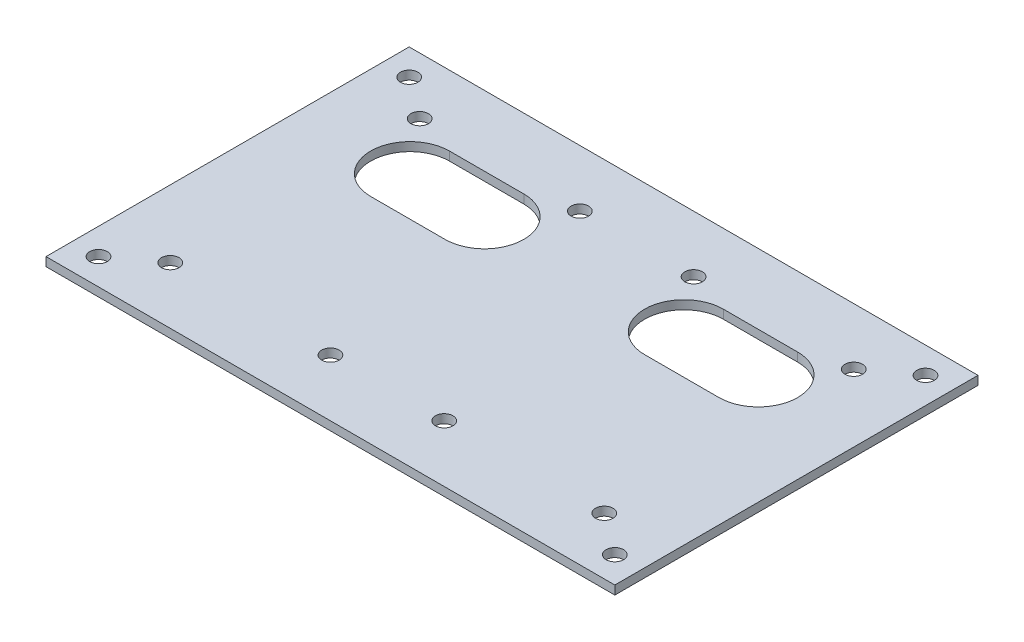
ISO-10303-21;
HEADER;
FILE_DESCRIPTION(('STEP AP214'),'2;1');
FILE_NAME('part.step','',(''),(''),'','','');
FILE_SCHEMA(('AUTOMOTIVE_DESIGN { 1 0 10303 214 1 1 1 1 }'));
ENDSEC;
DATA;
#1=APPLICATION_CONTEXT('core data for automotive mechanical design processes');
#2=APPLICATION_PROTOCOL_DEFINITION('international standard','automotive_design',2000,#1);
#3=PRODUCT_CONTEXT('',#1,'mechanical');
#4=PRODUCT('Part','Part','',(#3));
#5=PRODUCT_RELATED_PRODUCT_CATEGORY('part','',(#4));
#6=PRODUCT_DEFINITION_FORMATION('','',#4);
#7=PRODUCT_DEFINITION_CONTEXT('part definition',#1,'design');
#8=PRODUCT_DEFINITION('design','',#6,#7);
#9=PRODUCT_DEFINITION_SHAPE('','',#8);
#10=(LENGTH_UNIT() NAMED_UNIT(*) SI_UNIT(.MILLI.,.METRE.));
#11=(NAMED_UNIT(*) PLANE_ANGLE_UNIT() SI_UNIT($,.RADIAN.));
#12=(NAMED_UNIT(*) SI_UNIT($,.STERADIAN.) SOLID_ANGLE_UNIT());
#13=UNCERTAINTY_MEASURE_WITH_UNIT(LENGTH_MEASURE(1.E-05),#10,'distance_accuracy_value','');
#14=(GEOMETRIC_REPRESENTATION_CONTEXT(3) GLOBAL_UNCERTAINTY_ASSIGNED_CONTEXT((#13)) GLOBAL_UNIT_ASSIGNED_CONTEXT((#10,
#11,#12)) REPRESENTATION_CONTEXT('',''));
#15=CARTESIAN_POINT('',(0.,0.,0.));
#16=DIRECTION('',(0.,0.,1.));
#17=DIRECTION('',(1.,0.,0.));
#18=AXIS2_PLACEMENT_3D('',#15,#16,#17);
#19=CARTESIAN_POINT('',(0.,2.,0.));
#20=DIRECTION('',(0.,1.,0.));
#21=DIRECTION('',(0.,0.,1.));
#22=AXIS2_PLACEMENT_3D('',#19,#20,#21);
#23=PLANE('',#22);
#24=CARTESIAN_POINT('',(59.,2.,35.5));
#25=DIRECTION('',(0.,1.,0.));
#26=DIRECTION('',(0.,0.,1.));
#27=AXIS2_PLACEMENT_3D('',#24,#25,#26);
#28=CIRCLE('',#27,2.);
#29=CARTESIAN_POINT('',(59.,2.,37.5));
#30=VERTEX_POINT('',#29);
#31=EDGE_CURVE('E197',#30,#30,#28,.T.);
#32=ORIENTED_EDGE('',*,*,#31,.F.);
#33=EDGE_LOOP('',(#32));
#34=FACE_BOUND('',#33,.T.);
#35=CARTESIAN_POINT('',(-59.,2.,-35.5));
#36=DIRECTION('',(0.,1.,0.));
#37=DIRECTION('',(0.,0.,1.));
#38=AXIS2_PLACEMENT_3D('',#35,#36,#37);
#39=CIRCLE('',#38,2.);
#40=CARTESIAN_POINT('',(-59.,2.,-33.5));
#41=VERTEX_POINT('',#40);
#42=EDGE_CURVE('E209',#41,#41,#39,.T.);
#43=ORIENTED_EDGE('',*,*,#42,.F.);
#44=EDGE_LOOP('',(#43));
#45=FACE_BOUND('',#44,.T.);
#46=CARTESIAN_POINT('',(-49.6,2.,-28.5));
#47=DIRECTION('',(0.,1.,0.));
#48=DIRECTION('',(0.,0.,-1.));
#49=AXIS2_PLACEMENT_3D('',#46,#47,#48);
#50=CIRCLE('',#49,2.);
#51=CARTESIAN_POINT('',(-49.6,2.,-30.5));
#52=VERTEX_POINT('',#51);
#53=EDGE_CURVE('E221',#52,#52,#50,.T.);
#54=ORIENTED_EDGE('',*,*,#53,.F.);
#55=EDGE_LOOP('',(#54));
#56=FACE_BOUND('',#55,.T.);
#57=CARTESIAN_POINT('',(-13.,2.,28.4999999999999));
#58=DIRECTION('',(0.,1.,0.));
#59=DIRECTION('',(0.,0.,-1.));
#60=AXIS2_PLACEMENT_3D('',#57,#58,#59);
#61=CIRCLE('',#60,2.);
#62=CARTESIAN_POINT('',(-13.,2.,26.4999999999999));
#63=VERTEX_POINT('',#62);
#64=EDGE_CURVE('E233',#63,#63,#61,.T.);
#65=ORIENTED_EDGE('',*,*,#64,.F.);
#66=EDGE_LOOP('',(#65));
#67=FACE_BOUND('',#66,.T.);
#68=CARTESIAN_POINT('',(49.6,2.,28.5));
#69=DIRECTION('',(0.,1.,0.));
#70=DIRECTION('',(0.,0.,1.));
#71=AXIS2_PLACEMENT_3D('',#68,#69,#70);
#72=CIRCLE('',#71,2.);
#73=CARTESIAN_POINT('',(49.6,2.,30.5));
#74=VERTEX_POINT('',#73);
#75=EDGE_CURVE('E245',#74,#74,#72,.T.);
#76=ORIENTED_EDGE('',*,*,#75,.F.);
#77=EDGE_LOOP('',(#76));
#78=FACE_BOUND('',#77,.T.);
#79=CARTESIAN_POINT('',(13.,2.,-28.5));
#80=DIRECTION('',(0.,1.,0.));
#81=DIRECTION('',(0.,0.,1.));
#82=AXIS2_PLACEMENT_3D('',#79,#80,#81);
#83=CIRCLE('',#82,2.);
#84=CARTESIAN_POINT('',(13.,2.,-26.5));
#85=VERTEX_POINT('',#84);
#86=EDGE_CURVE('E257',#85,#85,#83,.T.);
#87=ORIENTED_EDGE('',*,*,#86,.F.);
#88=EDGE_LOOP('',(#87));
#89=FACE_BOUND('',#88,.T.);
#90=DIRECTION('',(0.,0.,-1.));
#91=VECTOR('',#90,1.);
#92=CARTESIAN_POINT('',(65.,2.,-41.5));
#93=LINE('',#92,#91);
#94=CARTESIAN_POINT('',(65.,2.,41.5));
#95=VERTEX_POINT('',#94);
#96=CARTESIAN_POINT('',(65.,2.,-41.5));
#97=VERTEX_POINT('',#96);
#98=EDGE_CURVE('E263',#95,#97,#93,.T.);
#99=ORIENTED_EDGE('',*,*,#98,.T.);
#100=DIRECTION('',(-1.,0.,0.));
#101=VECTOR('',#100,1.);
#102=CARTESIAN_POINT('',(-65.,2.,-41.5));
#103=LINE('',#102,#101);
#104=CARTESIAN_POINT('',(-65.,2.,-41.5));
#105=VERTEX_POINT('',#104);
#106=EDGE_CURVE('E266',#97,#105,#103,.T.);
#107=ORIENTED_EDGE('',*,*,#106,.T.);
#108=DIRECTION('',(0.,0.,1.));
#109=VECTOR('',#108,1.);
#110=CARTESIAN_POINT('',(-65.,2.,-41.5));
#111=LINE('',#110,#109);
#112=CARTESIAN_POINT('',(-65.,2.,41.5));
#113=VERTEX_POINT('',#112);
#114=EDGE_CURVE('E269',#105,#113,#111,.T.);
#115=ORIENTED_EDGE('',*,*,#114,.T.);
#116=DIRECTION('',(1.,0.,0.));
#117=VECTOR('',#116,1.);
#118=CARTESIAN_POINT('',(-65.,2.,41.5));
#119=LINE('',#118,#117);
#120=EDGE_CURVE('E271',#113,#95,#119,.T.);
#121=ORIENTED_EDGE('',*,*,#120,.T.);
#122=EDGE_LOOP('',(#99,#107,#115,#121));
#123=FACE_BOUND('',#122,.T.);
#124=CARTESIAN_POINT('',(49.6,2.,-28.5));
#125=DIRECTION('',(0.,1.,0.));
#126=DIRECTION('',(0.,0.,1.));
#127=AXIS2_PLACEMENT_3D('',#124,#125,#126);
#128=CIRCLE('',#127,2.);
#129=CARTESIAN_POINT('',(49.6,2.,-26.5));
#130=VERTEX_POINT('',#129);
#131=EDGE_CURVE('E251',#130,#130,#128,.T.);
#132=ORIENTED_EDGE('',*,*,#131,.F.);
#133=EDGE_LOOP('',(#132));
#134=FACE_BOUND('',#133,.T.);
#135=CARTESIAN_POINT('',(13.,2.,28.5));
#136=DIRECTION('',(0.,1.,0.));
#137=DIRECTION('',(0.,0.,1.));
#138=AXIS2_PLACEMENT_3D('',#135,#136,#137);
#139=CIRCLE('',#138,2.);
#140=CARTESIAN_POINT('',(13.,2.,30.5));
#141=VERTEX_POINT('',#140);
#142=EDGE_CURVE('E239',#141,#141,#139,.T.);
#143=ORIENTED_EDGE('',*,*,#142,.F.);
#144=EDGE_LOOP('',(#143));
#145=FACE_BOUND('',#144,.T.);
#146=CARTESIAN_POINT('',(-49.6,2.,28.4999999999999));
#147=DIRECTION('',(0.,1.,0.));
#148=DIRECTION('',(0.,0.,-1.));
#149=AXIS2_PLACEMENT_3D('',#146,#147,#148);
#150=CIRCLE('',#149,2.);
#151=CARTESIAN_POINT('',(-49.6,2.,26.4999999999999));
#152=VERTEX_POINT('',#151);
#153=EDGE_CURVE('E227',#152,#152,#150,.T.);
#154=ORIENTED_EDGE('',*,*,#153,.F.);
#155=EDGE_LOOP('',(#154));
#156=FACE_BOUND('',#155,.T.);
#157=CARTESIAN_POINT('',(-13.,2.,-28.5));
#158=DIRECTION('',(0.,1.,0.));
#159=DIRECTION('',(0.,0.,-1.));
#160=AXIS2_PLACEMENT_3D('',#157,#158,#159);
#161=CIRCLE('',#160,2.);
#162=CARTESIAN_POINT('',(-13.,2.,-30.5));
#163=VERTEX_POINT('',#162);
#164=EDGE_CURVE('E215',#163,#163,#161,.T.);
#165=ORIENTED_EDGE('',*,*,#164,.F.);
#166=EDGE_LOOP('',(#165));
#167=FACE_BOUND('',#166,.T.);
#168=CARTESIAN_POINT('',(59.,2.,-35.5));
#169=DIRECTION('',(0.,1.,0.));
#170=DIRECTION('',(0.,0.,1.));
#171=AXIS2_PLACEMENT_3D('',#168,#169,#170);
#172=CIRCLE('',#171,2.);
#173=CARTESIAN_POINT('',(59.,2.,-33.5));
#174=VERTEX_POINT('',#173);
#175=EDGE_CURVE('E203',#174,#174,#172,.T.);
#176=ORIENTED_EDGE('',*,*,#175,.F.);
#177=EDGE_LOOP('',(#176));
#178=FACE_BOUND('',#177,.T.);
#179=CARTESIAN_POINT('',(-59.,2.,35.5));
#180=DIRECTION('',(0.,1.,0.));
#181=DIRECTION('',(0.,0.,1.));
#182=AXIS2_PLACEMENT_3D('',#179,#180,#181);
#183=CIRCLE('',#182,2.);
#184=CARTESIAN_POINT('',(-59.,2.,37.5));
#185=VERTEX_POINT('',#184);
#186=EDGE_CURVE('E191',#185,#185,#183,.T.);
#187=ORIENTED_EDGE('',*,*,#186,.F.);
#188=EDGE_LOOP('',(#187));
#189=FACE_BOUND('',#188,.T.);
#190=DIRECTION('',(1.,0.,0.));
#191=VECTOR('',#190,1.);
#192=CARTESIAN_POINT('',(22.8,2.,-7.50000000000003));
#193=LINE('',#192,#191);
#194=CARTESIAN_POINT('',(22.8,2.,-7.50000000000003));
#195=VERTEX_POINT('',#194);
#196=CARTESIAN_POINT('',(39.8,2.,-7.50000000000003));
#197=VERTEX_POINT('',#196);
#198=EDGE_CURVE('E162',#195,#197,#193,.T.);
#199=ORIENTED_EDGE('',*,*,#198,.F.);
#200=CARTESIAN_POINT('',(22.8,2.,-16.5));
#201=DIRECTION('',(0.,1.,0.));
#202=DIRECTION('',(0.,0.,1.));
#203=AXIS2_PLACEMENT_3D('',#200,#201,#202);
#204=CIRCLE('',#203,8.99999999999999);
#205=CARTESIAN_POINT('',(22.8,2.,-25.5));
#206=VERTEX_POINT('',#205);
#207=EDGE_CURVE('E160',#206,#195,#204,.T.);
#208=ORIENTED_EDGE('',*,*,#207,.F.);
#209=DIRECTION('',(-1.,0.,0.));
#210=VECTOR('',#209,1.);
#211=CARTESIAN_POINT('',(22.8,2.,-25.5));
#212=LINE('',#211,#210);
#213=CARTESIAN_POINT('',(39.8,2.,-25.5));
#214=VERTEX_POINT('',#213);
#215=EDGE_CURVE('E168',#214,#206,#212,.T.);
#216=ORIENTED_EDGE('',*,*,#215,.F.);
#217=CARTESIAN_POINT('',(39.8,2.,-16.5));
#218=DIRECTION('',(0.,1.,0.));
#219=DIRECTION('',(0.,0.,1.));
#220=AXIS2_PLACEMENT_3D('',#217,#218,#219);
#221=CIRCLE('',#220,8.99999999999999);
#222=EDGE_CURVE('E165',#197,#214,#221,.T.);
#223=ORIENTED_EDGE('',*,*,#222,.F.);
#224=EDGE_LOOP('',(#199,#208,#216,#223));
#225=FACE_BOUND('',#224,.T.);
#226=DIRECTION('',(-1.,0.,0.));
#227=VECTOR('',#226,1.);
#228=CARTESIAN_POINT('',(-22.8,2.,-25.5));
#229=LINE('',#228,#227);
#230=CARTESIAN_POINT('',(-22.8,2.,-25.5));
#231=VERTEX_POINT('',#230);
#232=CARTESIAN_POINT('',(-39.8,2.,-25.5));
#233=VERTEX_POINT('',#232);
#234=EDGE_CURVE('E132',#231,#233,#229,.T.);
#235=ORIENTED_EDGE('',*,*,#234,.F.);
#236=CARTESIAN_POINT('',(-22.8,2.,-16.5000000000001));
#237=DIRECTION('',(0.,1.,0.));
#238=DIRECTION('',(0.,0.,-1.));
#239=AXIS2_PLACEMENT_3D('',#236,#237,#238);
#240=CIRCLE('',#239,8.99999999999999);
#241=CARTESIAN_POINT('',(-22.8,2.,-7.50000000000006));
#242=VERTEX_POINT('',#241);
#243=EDGE_CURVE('E124',#242,#231,#240,.T.);
#244=ORIENTED_EDGE('',*,*,#243,.F.);
#245=DIRECTION('',(1.,0.,0.));
#246=VECTOR('',#245,1.);
#247=CARTESIAN_POINT('',(-22.8,2.,-7.50000000000006));
#248=LINE('',#247,#246);
#249=CARTESIAN_POINT('',(-39.8,2.,-7.50000000000006));
#250=VERTEX_POINT('',#249);
#251=EDGE_CURVE('E146',#250,#242,#248,.T.);
#252=ORIENTED_EDGE('',*,*,#251,.F.);
#253=CARTESIAN_POINT('',(-39.8,2.,-16.5000000000001));
#254=DIRECTION('',(0.,1.,0.));
#255=DIRECTION('',(0.,0.,-1.));
#256=AXIS2_PLACEMENT_3D('',#253,#254,#255);
#257=CIRCLE('',#256,8.99999999999999);
#258=EDGE_CURVE('E144',#233,#250,#257,.T.);
#259=ORIENTED_EDGE('',*,*,#258,.F.);
#260=EDGE_LOOP('',(#235,#244,#252,#259));
#261=FACE_BOUND('',#260,.T.);
#262=ADVANCED_FACE('F35',(#34,#45,#56,#67,#78,#89,#123,#134,#145,#156,#167,#178,#189,#225,#261),
#23,.T.);
#263=CARTESIAN_POINT('',(0.,0.,0.));
#264=DIRECTION('',(0.,1.,0.));
#265=DIRECTION('',(0.,0.,1.));
#266=AXIS2_PLACEMENT_3D('',#263,#264,#265);
#267=PLANE('',#266);
#268=CARTESIAN_POINT('',(22.8,0.,-16.5));
#269=DIRECTION('',(0.,1.,0.));
#270=DIRECTION('',(0.,0.,1.));
#271=AXIS2_PLACEMENT_3D('',#268,#269,#270);
#272=CIRCLE('',#271,8.99999999999999);
#273=CARTESIAN_POINT('',(22.8,0.,-25.5));
#274=VERTEX_POINT('',#273);
#275=CARTESIAN_POINT('',(22.8,0.,-7.50000000000003));
#276=VERTEX_POINT('',#275);
#277=EDGE_CURVE('E140',#274,#276,#272,.T.);
#278=ORIENTED_EDGE('',*,*,#277,.T.);
#279=DIRECTION('',(1.,0.,0.));
#280=VECTOR('',#279,1.);
#281=CARTESIAN_POINT('',(22.8,0.,-7.50000000000003));
#282=LINE('',#281,#280);
#283=CARTESIAN_POINT('',(39.8,0.,-7.50000000000003));
#284=VERTEX_POINT('',#283);
#285=EDGE_CURVE('E173',#276,#284,#282,.T.);
#286=ORIENTED_EDGE('',*,*,#285,.T.);
#287=CARTESIAN_POINT('',(39.8,0.,-16.5));
#288=DIRECTION('',(0.,1.,0.));
#289=DIRECTION('',(0.,0.,1.));
#290=AXIS2_PLACEMENT_3D('',#287,#288,#289);
#291=CIRCLE('',#290,8.99999999999999);
#292=CARTESIAN_POINT('',(39.8,0.,-25.5));
#293=VERTEX_POINT('',#292);
#294=EDGE_CURVE('E176',#284,#293,#291,.T.);
#295=ORIENTED_EDGE('',*,*,#294,.T.);
#296=DIRECTION('',(-1.,0.,0.));
#297=VECTOR('',#296,1.);
#298=CARTESIAN_POINT('',(22.8,0.,-25.5));
#299=LINE('',#298,#297);
#300=EDGE_CURVE('E163',#293,#274,#299,.T.);
#301=ORIENTED_EDGE('',*,*,#300,.T.);
#302=EDGE_LOOP('',(#278,#286,#295,#301));
#303=FACE_BOUND('',#302,.T.);
#304=DIRECTION('',(0.,0.,-1.));
#305=VECTOR('',#304,1.);
#306=CARTESIAN_POINT('',(65.,0.,-41.5));
#307=LINE('',#306,#305);
#308=CARTESIAN_POINT('',(65.,0.,41.5));
#309=VERTEX_POINT('',#308);
#310=CARTESIAN_POINT('',(65.,0.,-41.5));
#311=VERTEX_POINT('',#310);
#312=EDGE_CURVE('E260',#309,#311,#307,.T.);
#313=ORIENTED_EDGE('',*,*,#312,.F.);
#314=DIRECTION('',(1.,0.,0.));
#315=VECTOR('',#314,1.);
#316=CARTESIAN_POINT('',(-65.,0.,41.5));
#317=LINE('',#316,#315);
#318=CARTESIAN_POINT('',(-65.,0.,41.5));
#319=VERTEX_POINT('',#318);
#320=EDGE_CURVE('E267',#319,#309,#317,.T.);
#321=ORIENTED_EDGE('',*,*,#320,.F.);
#322=DIRECTION('',(0.,0.,1.));
#323=VECTOR('',#322,1.);
#324=CARTESIAN_POINT('',(-65.,0.,-41.5));
#325=LINE('',#324,#323);
#326=CARTESIAN_POINT('',(-65.,0.,-41.5));
#327=VERTEX_POINT('',#326);
#328=EDGE_CURVE('E278',#327,#319,#325,.T.);
#329=ORIENTED_EDGE('',*,*,#328,.F.);
#330=DIRECTION('',(-1.,0.,0.));
#331=VECTOR('',#330,1.);
#332=CARTESIAN_POINT('',(-65.,0.,-41.5));
#333=LINE('',#332,#331);
#334=EDGE_CURVE('E276',#311,#327,#333,.T.);
#335=ORIENTED_EDGE('',*,*,#334,.F.);
#336=EDGE_LOOP('',(#313,#321,#329,#335));
#337=FACE_BOUND('',#336,.T.);
#338=CARTESIAN_POINT('',(13.,0.,-28.5));
#339=DIRECTION('',(0.,1.,0.));
#340=DIRECTION('',(0.,0.,1.));
#341=AXIS2_PLACEMENT_3D('',#338,#339,#340);
#342=CIRCLE('',#341,2.);
#343=CARTESIAN_POINT('',(13.,0.,-26.5));
#344=VERTEX_POINT('',#343);
#345=EDGE_CURVE('E254',#344,#344,#342,.T.);
#346=ORIENTED_EDGE('',*,*,#345,.T.);
#347=EDGE_LOOP('',(#346));
#348=FACE_BOUND('',#347,.T.);
#349=CARTESIAN_POINT('',(49.6,0.,-28.5));
#350=DIRECTION('',(0.,1.,0.));
#351=DIRECTION('',(0.,0.,1.));
#352=AXIS2_PLACEMENT_3D('',#349,#350,#351);
#353=CIRCLE('',#352,2.);
#354=CARTESIAN_POINT('',(49.6,0.,-26.5));
#355=VERTEX_POINT('',#354);
#356=EDGE_CURVE('E248',#355,#355,#353,.T.);
#357=ORIENTED_EDGE('',*,*,#356,.T.);
#358=EDGE_LOOP('',(#357));
#359=FACE_BOUND('',#358,.T.);
#360=CARTESIAN_POINT('',(49.6,0.,28.5));
#361=DIRECTION('',(0.,1.,0.));
#362=DIRECTION('',(0.,0.,1.));
#363=AXIS2_PLACEMENT_3D('',#360,#361,#362);
#364=CIRCLE('',#363,2.);
#365=CARTESIAN_POINT('',(49.6,0.,30.5));
#366=VERTEX_POINT('',#365);
#367=EDGE_CURVE('E242',#366,#366,#364,.T.);
#368=ORIENTED_EDGE('',*,*,#367,.T.);
#369=EDGE_LOOP('',(#368));
#370=FACE_BOUND('',#369,.T.);
#371=CARTESIAN_POINT('',(13.,0.,28.5));
#372=DIRECTION('',(0.,1.,0.));
#373=DIRECTION('',(0.,0.,1.));
#374=AXIS2_PLACEMENT_3D('',#371,#372,#373);
#375=CIRCLE('',#374,2.);
#376=CARTESIAN_POINT('',(13.,0.,30.5));
#377=VERTEX_POINT('',#376);
#378=EDGE_CURVE('E236',#377,#377,#375,.T.);
#379=ORIENTED_EDGE('',*,*,#378,.T.);
#380=EDGE_LOOP('',(#379));
#381=FACE_BOUND('',#380,.T.);
#382=CARTESIAN_POINT('',(-13.,0.,28.4999999999999));
#383=DIRECTION('',(0.,1.,0.));
#384=DIRECTION('',(0.,0.,-1.));
#385=AXIS2_PLACEMENT_3D('',#382,#383,#384);
#386=CIRCLE('',#385,2.);
#387=CARTESIAN_POINT('',(-13.,0.,26.4999999999999));
#388=VERTEX_POINT('',#387);
#389=EDGE_CURVE('E230',#388,#388,#386,.T.);
#390=ORIENTED_EDGE('',*,*,#389,.T.);
#391=EDGE_LOOP('',(#390));
#392=FACE_BOUND('',#391,.T.);
#393=CARTESIAN_POINT('',(-49.6,0.,28.4999999999999));
#394=DIRECTION('',(0.,1.,0.));
#395=DIRECTION('',(0.,0.,-1.));
#396=AXIS2_PLACEMENT_3D('',#393,#394,#395);
#397=CIRCLE('',#396,2.);
#398=CARTESIAN_POINT('',(-49.6,0.,26.4999999999999));
#399=VERTEX_POINT('',#398);
#400=EDGE_CURVE('E224',#399,#399,#397,.T.);
#401=ORIENTED_EDGE('',*,*,#400,.T.);
#402=EDGE_LOOP('',(#401));
#403=FACE_BOUND('',#402,.T.);
#404=CARTESIAN_POINT('',(-49.6,0.,-28.5));
#405=DIRECTION('',(0.,1.,0.));
#406=DIRECTION('',(0.,0.,-1.));
#407=AXIS2_PLACEMENT_3D('',#404,#405,#406);
#408=CIRCLE('',#407,2.);
#409=CARTESIAN_POINT('',(-49.6,0.,-30.5));
#410=VERTEX_POINT('',#409);
#411=EDGE_CURVE('E218',#410,#410,#408,.T.);
#412=ORIENTED_EDGE('',*,*,#411,.T.);
#413=EDGE_LOOP('',(#412));
#414=FACE_BOUND('',#413,.T.);
#415=CARTESIAN_POINT('',(-13.,0.,-28.5));
#416=DIRECTION('',(0.,1.,0.));
#417=DIRECTION('',(0.,0.,-1.));
#418=AXIS2_PLACEMENT_3D('',#415,#416,#417);
#419=CIRCLE('',#418,2.);
#420=CARTESIAN_POINT('',(-13.,0.,-30.5));
#421=VERTEX_POINT('',#420);
#422=EDGE_CURVE('E212',#421,#421,#419,.T.);
#423=ORIENTED_EDGE('',*,*,#422,.T.);
#424=EDGE_LOOP('',(#423));
#425=FACE_BOUND('',#424,.T.);
#426=CARTESIAN_POINT('',(-59.,0.,-35.5));
#427=DIRECTION('',(0.,1.,0.));
#428=DIRECTION('',(0.,0.,1.));
#429=AXIS2_PLACEMENT_3D('',#426,#427,#428);
#430=CIRCLE('',#429,2.);
#431=CARTESIAN_POINT('',(-59.,0.,-33.5));
#432=VERTEX_POINT('',#431);
#433=EDGE_CURVE('E206',#432,#432,#430,.T.);
#434=ORIENTED_EDGE('',*,*,#433,.T.);
#435=EDGE_LOOP('',(#434));
#436=FACE_BOUND('',#435,.T.);
#437=CARTESIAN_POINT('',(59.,0.,-35.5));
#438=DIRECTION('',(0.,1.,0.));
#439=DIRECTION('',(0.,0.,1.));
#440=AXIS2_PLACEMENT_3D('',#437,#438,#439);
#441=CIRCLE('',#440,2.);
#442=CARTESIAN_POINT('',(59.,0.,-33.5));
#443=VERTEX_POINT('',#442);
#444=EDGE_CURVE('E200',#443,#443,#441,.T.);
#445=ORIENTED_EDGE('',*,*,#444,.T.);
#446=EDGE_LOOP('',(#445));
#447=FACE_BOUND('',#446,.T.);
#448=CARTESIAN_POINT('',(59.,0.,35.5));
#449=DIRECTION('',(0.,1.,0.));
#450=DIRECTION('',(0.,0.,1.));
#451=AXIS2_PLACEMENT_3D('',#448,#449,#450);
#452=CIRCLE('',#451,2.);
#453=CARTESIAN_POINT('',(59.,0.,37.5));
#454=VERTEX_POINT('',#453);
#455=EDGE_CURVE('E194',#454,#454,#452,.T.);
#456=ORIENTED_EDGE('',*,*,#455,.T.);
#457=EDGE_LOOP('',(#456));
#458=FACE_BOUND('',#457,.T.);
#459=CARTESIAN_POINT('',(-59.,0.,35.5));
#460=DIRECTION('',(0.,1.,0.));
#461=DIRECTION('',(0.,0.,1.));
#462=AXIS2_PLACEMENT_3D('',#459,#460,#461);
#463=CIRCLE('',#462,2.);
#464=CARTESIAN_POINT('',(-59.,0.,37.5));
#465=VERTEX_POINT('',#464);
#466=EDGE_CURVE('E190',#465,#465,#463,.T.);
#467=ORIENTED_EDGE('',*,*,#466,.T.);
#468=EDGE_LOOP('',(#467));
#469=FACE_BOUND('',#468,.T.);
#470=CARTESIAN_POINT('',(-22.8,0.,-16.5000000000001));
#471=DIRECTION('',(0.,1.,0.));
#472=DIRECTION('',(0.,0.,-1.));
#473=AXIS2_PLACEMENT_3D('',#470,#471,#472);
#474=CIRCLE('',#473,8.99999999999999);
#475=CARTESIAN_POINT('',(-22.8,0.,-7.50000000000006));
#476=VERTEX_POINT('',#475);
#477=CARTESIAN_POINT('',(-22.8,0.,-25.5));
#478=VERTEX_POINT('',#477);
#479=EDGE_CURVE('E58',#476,#478,#474,.T.);
#480=ORIENTED_EDGE('',*,*,#479,.T.);
#481=DIRECTION('',(-1.,0.,0.));
#482=VECTOR('',#481,1.);
#483=CARTESIAN_POINT('',(-22.8,0.,-25.5));
#484=LINE('',#483,#482);
#485=CARTESIAN_POINT('',(-39.8,0.,-25.5));
#486=VERTEX_POINT('',#485);
#487=EDGE_CURVE('E139',#478,#486,#484,.T.);
#488=ORIENTED_EDGE('',*,*,#487,.T.);
#489=CARTESIAN_POINT('',(-39.8,0.,-16.5000000000001));
#490=DIRECTION('',(0.,1.,0.));
#491=DIRECTION('',(0.,0.,-1.));
#492=AXIS2_PLACEMENT_3D('',#489,#490,#491);
#493=CIRCLE('',#492,8.99999999999999);
#494=CARTESIAN_POINT('',(-39.8,0.,-7.50000000000007));
#495=VERTEX_POINT('',#494);
#496=EDGE_CURVE('E152',#486,#495,#493,.T.);
#497=ORIENTED_EDGE('',*,*,#496,.T.);
#498=DIRECTION('',(1.,0.,0.));
#499=VECTOR('',#498,1.);
#500=CARTESIAN_POINT('',(-22.8,0.,-7.50000000000006));
#501=LINE('',#500,#499);
#502=EDGE_CURVE('E133',#495,#476,#501,.T.);
#503=ORIENTED_EDGE('',*,*,#502,.T.);
#504=EDGE_LOOP('',(#480,#488,#497,#503));
#505=FACE_BOUND('',#504,.T.);
#506=ADVANCED_FACE('F296',(#303,#337,#348,#359,#370,#381,#392,#403,#414,#425,#436,#447,#458,
#469,#505),#267,.F.);
#507=CARTESIAN_POINT('',(65.,2.,-41.5));
#508=DIRECTION('',(-1.,0.,0.));
#509=DIRECTION('',(0.,0.,1.));
#510=AXIS2_PLACEMENT_3D('',#507,#508,#509);
#511=PLANE('',#510);
#512=ORIENTED_EDGE('',*,*,#312,.T.);
#513=DIRECTION('',(0.,-1.,0.));
#514=VECTOR('',#513,1.);
#515=CARTESIAN_POINT('',(65.,2.,-41.5));
#516=LINE('',#515,#514);
#517=EDGE_CURVE('E11',#97,#311,#516,.T.);
#518=ORIENTED_EDGE('',*,*,#517,.F.);
#519=ORIENTED_EDGE('',*,*,#98,.F.);
#520=DIRECTION('',(0.,-1.,0.));
#521=VECTOR('',#520,1.);
#522=CARTESIAN_POINT('',(65.,2.,41.5));
#523=LINE('',#522,#521);
#524=EDGE_CURVE('E273',#95,#309,#523,.T.);
#525=ORIENTED_EDGE('',*,*,#524,.T.);
#526=EDGE_LOOP('',(#512,#518,#519,#525));
#527=FACE_BOUND('',#526,.T.);
#528=ADVANCED_FACE('F37',(#527),#511,.F.);
#529=CARTESIAN_POINT('',(-65.,2.,-41.5));
#530=DIRECTION('',(0.,0.,1.));
#531=DIRECTION('',(1.,0.,0.));
#532=AXIS2_PLACEMENT_3D('',#529,#530,#531);
#533=PLANE('',#532);
#534=ORIENTED_EDGE('',*,*,#334,.T.);
#535=DIRECTION('',(0.,-1.,0.));
#536=VECTOR('',#535,1.);
#537=CARTESIAN_POINT('',(-65.,2.,-41.5));
#538=LINE('',#537,#536);
#539=EDGE_CURVE('E43',#105,#327,#538,.T.);
#540=ORIENTED_EDGE('',*,*,#539,.F.);
#541=ORIENTED_EDGE('',*,*,#106,.F.);
#542=ORIENTED_EDGE('',*,*,#517,.T.);
#543=EDGE_LOOP('',(#534,#540,#541,#542));
#544=FACE_BOUND('',#543,.T.);
#545=ADVANCED_FACE('F307',(#544),#533,.F.);
#546=CARTESIAN_POINT('',(-65.,2.,-41.5));
#547=DIRECTION('',(1.,0.,0.));
#548=DIRECTION('',(0.,0.,-1.));
#549=AXIS2_PLACEMENT_3D('',#546,#547,#548);
#550=PLANE('',#549);
#551=ORIENTED_EDGE('',*,*,#328,.T.);
#552=DIRECTION('',(0.,-1.,0.));
#553=VECTOR('',#552,1.);
#554=CARTESIAN_POINT('',(-65.,2.,41.5));
#555=LINE('',#554,#553);
#556=EDGE_CURVE('E283',#113,#319,#555,.T.);
#557=ORIENTED_EDGE('',*,*,#556,.F.);
#558=ORIENTED_EDGE('',*,*,#114,.F.);
#559=ORIENTED_EDGE('',*,*,#539,.T.);
#560=EDGE_LOOP('',(#551,#557,#558,#559));
#561=FACE_BOUND('',#560,.T.);
#562=ADVANCED_FACE('F290',(#561),#550,.F.);
#563=CARTESIAN_POINT('',(-65.,2.,41.5));
#564=DIRECTION('',(0.,0.,-1.));
#565=DIRECTION('',(-1.,0.,0.));
#566=AXIS2_PLACEMENT_3D('',#563,#564,#565);
#567=PLANE('',#566);
#568=ORIENTED_EDGE('',*,*,#320,.T.);
#569=ORIENTED_EDGE('',*,*,#524,.F.);
#570=ORIENTED_EDGE('',*,*,#120,.F.);
#571=ORIENTED_EDGE('',*,*,#556,.T.);
#572=EDGE_LOOP('',(#568,#569,#570,#571));
#573=FACE_BOUND('',#572,.T.);
#574=ADVANCED_FACE('F300',(#573),#567,.F.);
#575=CARTESIAN_POINT('',(13.,2.,-28.5));
#576=DIRECTION('',(0.,-1.,0.));
#577=DIRECTION('',(0.,0.,-1.));
#578=AXIS2_PLACEMENT_3D('',#575,#576,#577);
#579=CYLINDRICAL_SURFACE('',#578,2.);
#580=ORIENTED_EDGE('',*,*,#86,.T.);
#581=EDGE_LOOP('',(#580));
#582=FACE_BOUND('',#581,.T.);
#583=ORIENTED_EDGE('',*,*,#345,.F.);
#584=EDGE_LOOP('',(#583));
#585=FACE_BOUND('',#584,.T.);
#586=ADVANCED_FACE('F325',(#582,#585),#579,.F.);
#587=CARTESIAN_POINT('',(49.6,2.,-28.5));
#588=DIRECTION('',(0.,-1.,0.));
#589=DIRECTION('',(0.,0.,-1.));
#590=AXIS2_PLACEMENT_3D('',#587,#588,#589);
#591=CYLINDRICAL_SURFACE('',#590,2.);
#592=ORIENTED_EDGE('',*,*,#131,.T.);
#593=EDGE_LOOP('',(#592));
#594=FACE_BOUND('',#593,.T.);
#595=ORIENTED_EDGE('',*,*,#356,.F.);
#596=EDGE_LOOP('',(#595));
#597=FACE_BOUND('',#596,.T.);
#598=ADVANCED_FACE('F332',(#594,#597),#591,.F.);
#599=CARTESIAN_POINT('',(49.6,2.,28.5));
#600=DIRECTION('',(0.,-1.,0.));
#601=DIRECTION('',(0.,0.,-1.));
#602=AXIS2_PLACEMENT_3D('',#599,#600,#601);
#603=CYLINDRICAL_SURFACE('',#602,2.);
#604=ORIENTED_EDGE('',*,*,#75,.T.);
#605=EDGE_LOOP('',(#604));
#606=FACE_BOUND('',#605,.T.);
#607=ORIENTED_EDGE('',*,*,#367,.F.);
#608=EDGE_LOOP('',(#607));
#609=FACE_BOUND('',#608,.T.);
#610=ADVANCED_FACE('F337',(#606,#609),#603,.F.);
#611=CARTESIAN_POINT('',(13.,2.,28.5));
#612=DIRECTION('',(0.,-1.,0.));
#613=DIRECTION('',(0.,0.,-1.));
#614=AXIS2_PLACEMENT_3D('',#611,#612,#613);
#615=CYLINDRICAL_SURFACE('',#614,2.);
#616=ORIENTED_EDGE('',*,*,#142,.T.);
#617=EDGE_LOOP('',(#616));
#618=FACE_BOUND('',#617,.T.);
#619=ORIENTED_EDGE('',*,*,#378,.F.);
#620=EDGE_LOOP('',(#619));
#621=FACE_BOUND('',#620,.T.);
#622=ADVANCED_FACE('F427',(#618,#621),#615,.F.);
#623=CARTESIAN_POINT('',(-13.,2.,28.4999999999999));
#624=DIRECTION('',(0.,-1.,0.));
#625=DIRECTION('',(0.,0.,-1.));
#626=AXIS2_PLACEMENT_3D('',#623,#624,#625);
#627=CYLINDRICAL_SURFACE('',#626,2.);
#628=ORIENTED_EDGE('',*,*,#64,.T.);
#629=EDGE_LOOP('',(#628));
#630=FACE_BOUND('',#629,.T.);
#631=ORIENTED_EDGE('',*,*,#389,.F.);
#632=EDGE_LOOP('',(#631));
#633=FACE_BOUND('',#632,.T.);
#634=ADVANCED_FACE('F423',(#630,#633),#627,.F.);
#635=CARTESIAN_POINT('',(-49.6,2.,28.4999999999999));
#636=DIRECTION('',(0.,-1.,0.));
#637=DIRECTION('',(0.,0.,-1.));
#638=AXIS2_PLACEMENT_3D('',#635,#636,#637);
#639=CYLINDRICAL_SURFACE('',#638,2.);
#640=ORIENTED_EDGE('',*,*,#153,.T.);
#641=EDGE_LOOP('',(#640));
#642=FACE_BOUND('',#641,.T.);
#643=ORIENTED_EDGE('',*,*,#400,.F.);
#644=EDGE_LOOP('',(#643));
#645=FACE_BOUND('',#644,.T.);
#646=ADVANCED_FACE('F419',(#642,#645),#639,.F.);
#647=CARTESIAN_POINT('',(-49.6,2.,-28.5));
#648=DIRECTION('',(0.,-1.,0.));
#649=DIRECTION('',(0.,0.,-1.));
#650=AXIS2_PLACEMENT_3D('',#647,#648,#649);
#651=CYLINDRICAL_SURFACE('',#650,2.);
#652=ORIENTED_EDGE('',*,*,#53,.T.);
#653=EDGE_LOOP('',(#652));
#654=FACE_BOUND('',#653,.T.);
#655=ORIENTED_EDGE('',*,*,#411,.F.);
#656=EDGE_LOOP('',(#655));
#657=FACE_BOUND('',#656,.T.);
#658=ADVANCED_FACE('F415',(#654,#657),#651,.F.);
#659=CARTESIAN_POINT('',(-13.,2.,-28.5));
#660=DIRECTION('',(0.,-1.,0.));
#661=DIRECTION('',(0.,0.,-1.));
#662=AXIS2_PLACEMENT_3D('',#659,#660,#661);
#663=CYLINDRICAL_SURFACE('',#662,2.);
#664=ORIENTED_EDGE('',*,*,#164,.T.);
#665=EDGE_LOOP('',(#664));
#666=FACE_BOUND('',#665,.T.);
#667=ORIENTED_EDGE('',*,*,#422,.F.);
#668=EDGE_LOOP('',(#667));
#669=FACE_BOUND('',#668,.T.);
#670=ADVANCED_FACE('F411',(#666,#669),#663,.F.);
#671=CARTESIAN_POINT('',(-59.,2.,-35.5));
#672=DIRECTION('',(0.,-1.,0.));
#673=DIRECTION('',(0.,0.,-1.));
#674=AXIS2_PLACEMENT_3D('',#671,#672,#673);
#675=CYLINDRICAL_SURFACE('',#674,2.);
#676=ORIENTED_EDGE('',*,*,#42,.T.);
#677=EDGE_LOOP('',(#676));
#678=FACE_BOUND('',#677,.T.);
#679=ORIENTED_EDGE('',*,*,#433,.F.);
#680=EDGE_LOOP('',(#679));
#681=FACE_BOUND('',#680,.T.);
#682=ADVANCED_FACE('F407',(#678,#681),#675,.F.);
#683=CARTESIAN_POINT('',(59.,2.,-35.5));
#684=DIRECTION('',(0.,-1.,0.));
#685=DIRECTION('',(0.,0.,-1.));
#686=AXIS2_PLACEMENT_3D('',#683,#684,#685);
#687=CYLINDRICAL_SURFACE('',#686,2.);
#688=ORIENTED_EDGE('',*,*,#175,.T.);
#689=EDGE_LOOP('',(#688));
#690=FACE_BOUND('',#689,.T.);
#691=ORIENTED_EDGE('',*,*,#444,.F.);
#692=EDGE_LOOP('',(#691));
#693=FACE_BOUND('',#692,.T.);
#694=ADVANCED_FACE('F403',(#690,#693),#687,.F.);
#695=CARTESIAN_POINT('',(59.,2.,35.5));
#696=DIRECTION('',(0.,-1.,0.));
#697=DIRECTION('',(0.,0.,-1.));
#698=AXIS2_PLACEMENT_3D('',#695,#696,#697);
#699=CYLINDRICAL_SURFACE('',#698,2.);
#700=ORIENTED_EDGE('',*,*,#31,.T.);
#701=EDGE_LOOP('',(#700));
#702=FACE_BOUND('',#701,.T.);
#703=ORIENTED_EDGE('',*,*,#455,.F.);
#704=EDGE_LOOP('',(#703));
#705=FACE_BOUND('',#704,.T.);
#706=ADVANCED_FACE('F399',(#702,#705),#699,.F.);
#707=CARTESIAN_POINT('',(-59.,2.,35.5));
#708=DIRECTION('',(0.,-1.,0.));
#709=DIRECTION('',(0.,0.,-1.));
#710=AXIS2_PLACEMENT_3D('',#707,#708,#709);
#711=CYLINDRICAL_SURFACE('',#710,2.);
#712=ORIENTED_EDGE('',*,*,#186,.T.);
#713=EDGE_LOOP('',(#712));
#714=FACE_BOUND('',#713,.T.);
#715=ORIENTED_EDGE('',*,*,#466,.F.);
#716=EDGE_LOOP('',(#715));
#717=FACE_BOUND('',#716,.T.);
#718=ADVANCED_FACE('F395',(#714,#717),#711,.F.);
#719=CARTESIAN_POINT('',(22.8,2.,-16.5));
#720=DIRECTION('',(0.,-1.,0.));
#721=DIRECTION('',(0.,0.,-1.));
#722=AXIS2_PLACEMENT_3D('',#719,#720,#721);
#723=CYLINDRICAL_SURFACE('',#722,8.99999999999999);
#724=ORIENTED_EDGE('',*,*,#277,.F.);
#725=DIRECTION('',(0.,-1.,0.));
#726=VECTOR('',#725,1.);
#727=CARTESIAN_POINT('',(22.8,2.,-25.5));
#728=LINE('',#727,#726);
#729=EDGE_CURVE('E170',#206,#274,#728,.T.);
#730=ORIENTED_EDGE('',*,*,#729,.F.);
#731=ORIENTED_EDGE('',*,*,#207,.T.);
#732=DIRECTION('',(0.,-1.,0.));
#733=VECTOR('',#732,1.);
#734=CARTESIAN_POINT('',(22.8,2.,-7.50000000000003));
#735=LINE('',#734,#733);
#736=EDGE_CURVE('E187',#195,#276,#735,.T.);
#737=ORIENTED_EDGE('',*,*,#736,.T.);
#738=EDGE_LOOP('',(#724,#730,#731,#737));
#739=FACE_BOUND('',#738,.T.);
#740=ADVANCED_FACE('F391',(#739),#723,.F.);
#741=CARTESIAN_POINT('',(22.8,2.,-7.50000000000003));
#742=DIRECTION('',(0.,0.,-1.));
#743=DIRECTION('',(-1.,0.,0.));
#744=AXIS2_PLACEMENT_3D('',#741,#742,#743);
#745=PLANE('',#744);
#746=ORIENTED_EDGE('',*,*,#285,.F.);
#747=ORIENTED_EDGE('',*,*,#736,.F.);
#748=ORIENTED_EDGE('',*,*,#198,.T.);
#749=DIRECTION('',(0.,-1.,0.));
#750=VECTOR('',#749,1.);
#751=CARTESIAN_POINT('',(39.8,2.,-7.50000000000003));
#752=LINE('',#751,#750);
#753=EDGE_CURVE('E185',#197,#284,#752,.T.);
#754=ORIENTED_EDGE('',*,*,#753,.T.);
#755=EDGE_LOOP('',(#746,#747,#748,#754));
#756=FACE_BOUND('',#755,.T.);
#757=ADVANCED_FACE('F387',(#756),#745,.T.);
#758=CARTESIAN_POINT('',(39.8,2.,-16.5));
#759=DIRECTION('',(0.,-1.,0.));
#760=DIRECTION('',(0.,0.,-1.));
#761=AXIS2_PLACEMENT_3D('',#758,#759,#760);
#762=CYLINDRICAL_SURFACE('',#761,8.99999999999999);
#763=ORIENTED_EDGE('',*,*,#294,.F.);
#764=ORIENTED_EDGE('',*,*,#753,.F.);
#765=ORIENTED_EDGE('',*,*,#222,.T.);
#766=DIRECTION('',(0.,-1.,0.));
#767=VECTOR('',#766,1.);
#768=CARTESIAN_POINT('',(39.8,2.,-25.5));
#769=LINE('',#768,#767);
#770=EDGE_CURVE('E183',#214,#293,#769,.T.);
#771=ORIENTED_EDGE('',*,*,#770,.T.);
#772=EDGE_LOOP('',(#763,#764,#765,#771));
#773=FACE_BOUND('',#772,.T.);
#774=ADVANCED_FACE('F383',(#773),#762,.F.);
#775=CARTESIAN_POINT('',(22.8,2.,-25.5));
#776=DIRECTION('',(0.,0.,1.));
#777=DIRECTION('',(1.,0.,0.));
#778=AXIS2_PLACEMENT_3D('',#775,#776,#777);
#779=PLANE('',#778);
#780=ORIENTED_EDGE('',*,*,#300,.F.);
#781=ORIENTED_EDGE('',*,*,#770,.F.);
#782=ORIENTED_EDGE('',*,*,#215,.T.);
#783=ORIENTED_EDGE('',*,*,#729,.T.);
#784=EDGE_LOOP('',(#780,#781,#782,#783));
#785=FACE_BOUND('',#784,.T.);
#786=ADVANCED_FACE('F380',(#785),#779,.T.);
#787=CARTESIAN_POINT('',(-22.8,2.,-16.5000000000001));
#788=DIRECTION('',(0.,-1.,0.));
#789=DIRECTION('',(0.,0.,-1.));
#790=AXIS2_PLACEMENT_3D('',#787,#788,#789);
#791=CYLINDRICAL_SURFACE('',#790,8.99999999999999);
#792=ORIENTED_EDGE('',*,*,#479,.F.);
#793=DIRECTION('',(0.,-1.,0.));
#794=VECTOR('',#793,1.);
#795=CARTESIAN_POINT('',(-22.8,2.,-7.50000000000006));
#796=LINE('',#795,#794);
#797=EDGE_CURVE('E128',#242,#476,#796,.T.);
#798=ORIENTED_EDGE('',*,*,#797,.F.);
#799=ORIENTED_EDGE('',*,*,#243,.T.);
#800=DIRECTION('',(0.,-1.,0.));
#801=VECTOR('',#800,1.);
#802=CARTESIAN_POINT('',(-22.8,2.,-25.5));
#803=LINE('',#802,#801);
#804=EDGE_CURVE('E127',#231,#478,#803,.T.);
#805=ORIENTED_EDGE('',*,*,#804,.T.);
#806=EDGE_LOOP('',(#792,#798,#799,#805));
#807=FACE_BOUND('',#806,.T.);
#808=ADVANCED_FACE('F126',(#807),#791,.F.);
#809=CARTESIAN_POINT('',(-22.8,2.,-25.5));
#810=DIRECTION('',(0.,0.,1.));
#811=DIRECTION('',(1.,0.,0.));
#812=AXIS2_PLACEMENT_3D('',#809,#810,#811);
#813=PLANE('',#812);
#814=ORIENTED_EDGE('',*,*,#487,.F.);
#815=ORIENTED_EDGE('',*,*,#804,.F.);
#816=ORIENTED_EDGE('',*,*,#234,.T.);
#817=DIRECTION('',(0.,-1.,0.));
#818=VECTOR('',#817,1.);
#819=CARTESIAN_POINT('',(-39.8,2.,-25.5));
#820=LINE('',#819,#818);
#821=EDGE_CURVE('E141',#233,#486,#820,.T.);
#822=ORIENTED_EDGE('',*,*,#821,.T.);
#823=EDGE_LOOP('',(#814,#815,#816,#822));
#824=FACE_BOUND('',#823,.T.);
#825=ADVANCED_FACE('F136',(#824),#813,.T.);
#826=CARTESIAN_POINT('',(-39.8,2.,-16.5000000000001));
#827=DIRECTION('',(0.,-1.,0.));
#828=DIRECTION('',(0.,0.,-1.));
#829=AXIS2_PLACEMENT_3D('',#826,#827,#828);
#830=CYLINDRICAL_SURFACE('',#829,8.99999999999999);
#831=ORIENTED_EDGE('',*,*,#496,.F.);
#832=ORIENTED_EDGE('',*,*,#821,.F.);
#833=ORIENTED_EDGE('',*,*,#258,.T.);
#834=DIRECTION('',(0.,-1.,0.));
#835=VECTOR('',#834,1.);
#836=CARTESIAN_POINT('',(-39.8,2.,-7.50000000000007));
#837=LINE('',#836,#835);
#838=EDGE_CURVE('E50',#250,#495,#837,.T.);
#839=ORIENTED_EDGE('',*,*,#838,.T.);
#840=EDGE_LOOP('',(#831,#832,#833,#839));
#841=FACE_BOUND('',#840,.T.);
#842=ADVANCED_FACE('F368',(#841),#830,.F.);
#843=CARTESIAN_POINT('',(-22.8,2.,-7.50000000000006));
#844=DIRECTION('',(0.,0.,-1.));
#845=DIRECTION('',(-1.,0.,0.));
#846=AXIS2_PLACEMENT_3D('',#843,#844,#845);
#847=PLANE('',#846);
#848=ORIENTED_EDGE('',*,*,#502,.F.);
#849=ORIENTED_EDGE('',*,*,#838,.F.);
#850=ORIENTED_EDGE('',*,*,#251,.T.);
#851=ORIENTED_EDGE('',*,*,#797,.T.);
#852=EDGE_LOOP('',(#848,#849,#850,#851));
#853=FACE_BOUND('',#852,.T.);
#854=ADVANCED_FACE('F366',(#853),#847,.T.);
#855=CLOSED_SHELL('',(#262,#506,#528,#545,#562,#574,#586,#598,#610,#622,#634,#646,#658,#670,
#682,#694,#706,#718,#740,#757,#774,#786,#808,#825,#842,#854));
#856=MANIFOLD_SOLID_BREP('B2',#855);
#857=ADVANCED_BREP_SHAPE_REPRESENTATION('',(#18,#856),#14);
#858=SHAPE_DEFINITION_REPRESENTATION(#9,#857);
ENDSEC;
END-ISO-10303-21;
